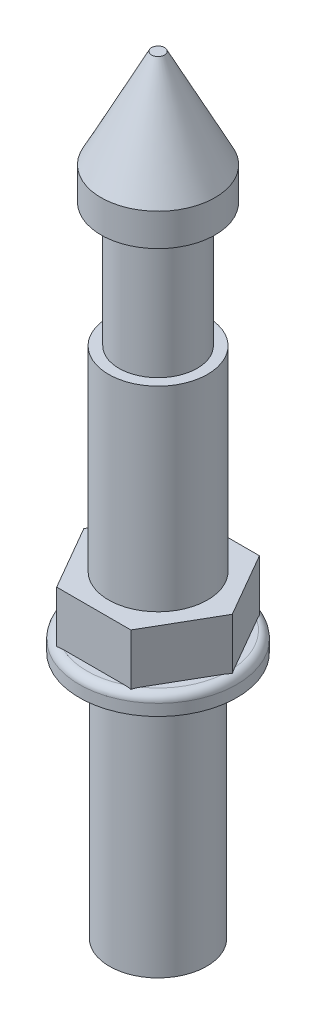
ISO-10303-21;
HEADER;
FILE_DESCRIPTION(('STEP AP214'),'2;1');
FILE_NAME('part.step','',(''),(''),'','','');
FILE_SCHEMA(('AUTOMOTIVE_DESIGN { 1 0 10303 214 1 1 1 1 }'));
ENDSEC;
DATA;
#1=APPLICATION_CONTEXT('core data for automotive mechanical design processes');
#2=APPLICATION_PROTOCOL_DEFINITION('international standard','automotive_design',2000,#1);
#3=PRODUCT_CONTEXT('',#1,'mechanical');
#4=PRODUCT('Part','Part','',(#3));
#5=PRODUCT_RELATED_PRODUCT_CATEGORY('part','',(#4));
#6=PRODUCT_DEFINITION_FORMATION('','',#4);
#7=PRODUCT_DEFINITION_CONTEXT('part definition',#1,'design');
#8=PRODUCT_DEFINITION('design','',#6,#7);
#9=PRODUCT_DEFINITION_SHAPE('','',#8);
#10=(LENGTH_UNIT() NAMED_UNIT(*) SI_UNIT(.MILLI.,.METRE.));
#11=(NAMED_UNIT(*) PLANE_ANGLE_UNIT() SI_UNIT($,.RADIAN.));
#12=(NAMED_UNIT(*) SI_UNIT($,.STERADIAN.) SOLID_ANGLE_UNIT());
#13=UNCERTAINTY_MEASURE_WITH_UNIT(LENGTH_MEASURE(1.E-05),#10,'distance_accuracy_value','');
#14=(GEOMETRIC_REPRESENTATION_CONTEXT(3) GLOBAL_UNCERTAINTY_ASSIGNED_CONTEXT((#13)) GLOBAL_UNIT_ASSIGNED_CONTEXT((#10,
#11,#12)) REPRESENTATION_CONTEXT('',''));
#15=CARTESIAN_POINT('',(0.,0.,0.));
#16=DIRECTION('',(0.,0.,1.));
#17=DIRECTION('',(1.,0.,0.));
#18=AXIS2_PLACEMENT_3D('',#15,#16,#17);
#19=CARTESIAN_POINT('',(0.,13.081,0.));
#20=DIRECTION('',(0.,-1.,0.));
#21=DIRECTION('',(0.,0.,-1.));
#22=AXIS2_PLACEMENT_3D('',#19,#20,#21);
#23=PLANE('',#22);
#24=DIRECTION('',(0.5,0.,-0.866025403784439));
#25=VECTOR('',#24,1.);
#26=CARTESIAN_POINT('',(3.63684481567929,13.081,0.));
#27=LINE('',#26,#25);
#28=CARTESIAN_POINT('',(1.98786542509556,13.081,2.85611608512498));
#29=VERTEX_POINT('',#28);
#30=CARTESIAN_POINT('',(3.46740179842337,13.081,0.293483914875022));
#31=VERTEX_POINT('',#30);
#32=EDGE_CURVE('E199',#29,#31,#27,.T.);
#33=ORIENTED_EDGE('',*,*,#32,.F.);
#34=CARTESIAN_POINT('',(0.,13.081,0.));
#35=DIRECTION('',(0.,-1.,0.));
#36=DIRECTION('',(0.,0.,-1.));
#37=AXIS2_PLACEMENT_3D('',#34,#35,#36);
#38=CIRCLE('',#37,3.4798);
#39=EDGE_CURVE('E216',#29,#31,#38,.F.);
#40=ORIENTED_EDGE('',*,*,#39,.T.);
#41=EDGE_LOOP('',(#33,#40));
#42=FACE_BOUND('',#41,.T.);
#43=ADVANCED_FACE('F37',(#42),#23,.F.);
#44=DIRECTION('',(-0.5,0.,-0.866025403784439));
#45=VECTOR('',#44,1.);
#46=CARTESIAN_POINT('',(1.81842240783965,13.081,-3.1496));
#47=LINE('',#46,#45);
#48=CARTESIAN_POINT('',(3.46740179842337,13.081,-0.293483914875021));
#49=VERTEX_POINT('',#48);
#50=CARTESIAN_POINT('',(1.98786542509557,13.081,-2.85611608512498));
#51=VERTEX_POINT('',#50);
#52=EDGE_CURVE('E152',#49,#51,#47,.T.);
#53=ORIENTED_EDGE('',*,*,#52,.F.);
#54=CARTESIAN_POINT('',(0.,13.081,0.));
#55=DIRECTION('',(0.,-1.,0.));
#56=DIRECTION('',(0.,0.,-1.));
#57=AXIS2_PLACEMENT_3D('',#54,#55,#56);
#58=CIRCLE('',#57,3.4798);
#59=EDGE_CURVE('E214',#49,#51,#58,.F.);
#60=ORIENTED_EDGE('',*,*,#59,.T.);
#61=EDGE_LOOP('',(#53,#60));
#62=FACE_BOUND('',#61,.T.);
#63=ADVANCED_FACE('F315',(#62),#23,.F.);
#64=DIRECTION('',(-1.,0.,0.));
#65=VECTOR('',#64,1.);
#66=CARTESIAN_POINT('',(-1.81842240783965,13.081,-3.1496));
#67=LINE('',#66,#65);
#68=CARTESIAN_POINT('',(1.47953637332781,13.081,-3.1496));
#69=VERTEX_POINT('',#68);
#70=CARTESIAN_POINT('',(-1.47953637332781,13.081,-3.1496));
#71=VERTEX_POINT('',#70);
#72=EDGE_CURVE('E155',#69,#71,#67,.T.);
#73=ORIENTED_EDGE('',*,*,#72,.F.);
#74=CARTESIAN_POINT('',(0.,13.081,0.));
#75=DIRECTION('',(0.,-1.,0.));
#76=DIRECTION('',(0.,0.,-1.));
#77=AXIS2_PLACEMENT_3D('',#74,#75,#76);
#78=CIRCLE('',#77,3.4798);
#79=EDGE_CURVE('E212',#69,#71,#78,.F.);
#80=ORIENTED_EDGE('',*,*,#79,.T.);
#81=EDGE_LOOP('',(#73,#80));
#82=FACE_BOUND('',#81,.T.);
#83=ADVANCED_FACE('F321',(#82),#23,.F.);
#84=DIRECTION('',(-0.5,0.,0.866025403784439));
#85=VECTOR('',#84,1.);
#86=CARTESIAN_POINT('',(-3.63684481567929,13.081,0.));
#87=LINE('',#86,#85);
#88=CARTESIAN_POINT('',(-1.98786542509556,13.081,-2.85611608512498));
#89=VERTEX_POINT('',#88);
#90=CARTESIAN_POINT('',(-3.46740179842337,13.081,-0.293483914875024));
#91=VERTEX_POINT('',#90);
#92=EDGE_CURVE('E347',#89,#91,#87,.T.);
#93=ORIENTED_EDGE('',*,*,#92,.F.);
#94=CARTESIAN_POINT('',(0.,13.081,0.));
#95=DIRECTION('',(0.,-1.,0.));
#96=DIRECTION('',(0.,0.,-1.));
#97=AXIS2_PLACEMENT_3D('',#94,#95,#96);
#98=CIRCLE('',#97,3.4798);
#99=EDGE_CURVE('E210',#89,#91,#98,.F.);
#100=ORIENTED_EDGE('',*,*,#99,.T.);
#101=EDGE_LOOP('',(#93,#100));
#102=FACE_BOUND('',#101,.T.);
#103=ADVANCED_FACE('F335',(#102),#23,.F.);
#104=DIRECTION('',(0.5,0.,0.866025403784439));
#105=VECTOR('',#104,1.);
#106=CARTESIAN_POINT('',(-1.81842240783965,13.081,3.1496));
#107=LINE('',#106,#105);
#108=CARTESIAN_POINT('',(-3.46740179842337,13.081,0.293483914875024));
#109=VERTEX_POINT('',#108);
#110=CARTESIAN_POINT('',(-1.98786542509557,13.081,2.85611608512498));
#111=VERTEX_POINT('',#110);
#112=EDGE_CURVE('E343',#109,#111,#107,.T.);
#113=ORIENTED_EDGE('',*,*,#112,.F.);
#114=CARTESIAN_POINT('',(0.,13.081,0.));
#115=DIRECTION('',(0.,-1.,0.));
#116=DIRECTION('',(0.,0.,-1.));
#117=AXIS2_PLACEMENT_3D('',#114,#115,#116);
#118=CIRCLE('',#117,3.4798);
#119=EDGE_CURVE('E208',#109,#111,#118,.F.);
#120=ORIENTED_EDGE('',*,*,#119,.T.);
#121=EDGE_LOOP('',(#113,#120));
#122=FACE_BOUND('',#121,.T.);
#123=ADVANCED_FACE('F241',(#122),#23,.F.);
#124=CARTESIAN_POINT('',(1.81842240783965,15.5702,-3.1496));
#125=DIRECTION('',(0.866025403784439,0.,-0.5));
#126=DIRECTION('',(-0.5,0.,-0.866025403784439));
#127=AXIS2_PLACEMENT_3D('',#124,#125,#126);
#128=PLANE('',#127);
#129=DIRECTION('',(0.,-1.,0.));
#130=VECTOR('',#129,1.);
#131=CARTESIAN_POINT('',(3.63684481567929,15.5702,0.));
#132=LINE('',#131,#130);
#133=CARTESIAN_POINT('',(3.63684481567929,15.5702,0.));
#134=VERTEX_POINT('',#133);
#135=CARTESIAN_POINT('',(3.63684481567929,13.0471281116084,0.));
#136=VERTEX_POINT('',#135);
#137=EDGE_CURVE('E128',#134,#136,#132,.T.);
#138=ORIENTED_EDGE('',*,*,#137,.T.);
#139=CARTESIAN_POINT('',(3.63684481567929,13.0471281116084,0.));
#140=CARTESIAN_POINT('',(3.62294238339711,13.0534042136599,-0.0240797190615206));
#141=CARTESIAN_POINT('',(3.60893347220989,13.058642846511,-0.0483438649964974));
#142=CARTESIAN_POINT('',(3.5808177331949,13.0673018510737,-0.0970417534628225));
#143=CARTESIAN_POINT('',(3.56671133013272,13.0707276787798,-0.121474760278549));
#144=CARTESIAN_POINT('',(3.53843999214469,13.0760507032769,-0.170442154071771));
#145=CARTESIAN_POINT('',(3.52427510229132,13.0779489133294,-0.194976462981424));
#146=CARTESIAN_POINT('',(3.4958726946034,13.0804230162406,-0.244170876154193));
#147=CARTESIAN_POINT('',(3.48163508673833,13.0809948864831,-0.268831136354733));
#148=CARTESIAN_POINT('',(3.46740179842337,13.081,-0.29348391487502));
#149=B_SPLINE_CURVE_WITH_KNOTS('',3,(#139,#140,#141,#142,#143,#144,#145,#146,#147,#148),
.UNSPECIFIED.,.F.,.F.,(4,2,2,2,4),(0.,0.0854638151773966,0.170668925734185,0.255817473468294,
0.341223929882869),.UNSPECIFIED.);
#150=EDGE_CURVE('E223',#136,#49,#149,.T.);
#151=ORIENTED_EDGE('',*,*,#150,.T.);
#152=ORIENTED_EDGE('',*,*,#52,.T.);
#153=CARTESIAN_POINT('',(1.98786542509557,13.081,-2.85611608512498));
#154=CARTESIAN_POINT('',(1.9736321367806,13.0809948864832,-2.88076886364528));
#155=CARTESIAN_POINT('',(1.95939452891552,13.0804230162406,-2.90542912384583));
#156=CARTESIAN_POINT('',(1.9309921212276,13.0779489133293,-2.9546235370186));
#157=CARTESIAN_POINT('',(1.91682723137423,13.0760507032769,-2.97915784592826));
#158=CARTESIAN_POINT('',(1.88855589338618,13.0707276787798,-3.0281252397215));
#159=CARTESIAN_POINT('',(1.874449490324,13.0673018510738,-3.05255824653725));
#160=CARTESIAN_POINT('',(1.84633375130899,13.0586428465109,-3.10125613500358));
#161=CARTESIAN_POINT('',(1.83232484012179,13.0534042136596,-3.12552028093854));
#162=CARTESIAN_POINT('',(1.81842240783965,13.0471281116076,-3.1496));
#163=B_SPLINE_CURVE_WITH_KNOTS('',3,(#153,#154,#155,#156,#157,#158,#159,#160,#161,#162),
.UNSPECIFIED.,.F.,.F.,(4,2,2,2,4),(0.,0.0854064564146084,0.170555004148727,0.255760114705559,
0.341223929883028),.UNSPECIFIED.);
#164=CARTESIAN_POINT('',(1.81842240783965,13.0471281116084,-3.1496));
#165=VERTEX_POINT('',#164);
#166=EDGE_CURVE('E245',#51,#165,#163,.T.);
#167=ORIENTED_EDGE('',*,*,#166,.T.);
#168=DIRECTION('',(0.,-1.,0.));
#169=VECTOR('',#168,1.);
#170=CARTESIAN_POINT('',(1.81842240783965,15.5702,-3.1496));
#171=LINE('',#170,#169);
#172=CARTESIAN_POINT('',(1.81842240783965,15.5702,-3.1496));
#173=VERTEX_POINT('',#172);
#174=EDGE_CURVE('E151',#173,#165,#171,.T.);
#175=ORIENTED_EDGE('',*,*,#174,.F.);
#176=DIRECTION('',(0.5,0.,0.866025403784439));
#177=VECTOR('',#176,1.);
#178=CARTESIAN_POINT('',(1.81842240783965,15.5702,-3.1496));
#179=LINE('',#178,#177);
#180=EDGE_CURVE('E144',#173,#134,#179,.T.);
#181=ORIENTED_EDGE('',*,*,#180,.T.);
#182=EDGE_LOOP('',(#138,#151,#152,#167,#175,#181));
#183=FACE_BOUND('',#182,.T.);
#184=ADVANCED_FACE('F149',(#183),#128,.T.);
#185=CARTESIAN_POINT('',(-1.81842240783965,15.5702,-3.1496));
#186=DIRECTION('',(0.,0.,-1.));
#187=DIRECTION('',(-1.,0.,0.));
#188=AXIS2_PLACEMENT_3D('',#185,#186,#187);
#189=PLANE('',#188);
#190=ORIENTED_EDGE('',*,*,#174,.T.);
#191=CARTESIAN_POINT('',(1.81842240783965,13.0471281116084,-3.1496));
#192=CARTESIAN_POINT('',(1.79061754327529,13.0534042136599,-3.1496));
#193=CARTESIAN_POINT('',(1.76259972090086,13.058642846511,-3.1496));
#194=CARTESIAN_POINT('',(1.70636824287086,13.0673018510737,-3.1496));
#195=CARTESIAN_POINT('',(1.67815543674651,13.0707276787798,-3.1496));
#196=CARTESIAN_POINT('',(1.62161276077045,13.0760507032769,-3.1496));
#197=CARTESIAN_POINT('',(1.59328298106371,13.0779489133294,-3.1496));
#198=CARTESIAN_POINT('',(1.53647816568786,13.0804230162406,-3.1496));
#199=CARTESIAN_POINT('',(1.50800294995773,13.0809948864831,-3.1496));
#200=CARTESIAN_POINT('',(1.47953637332781,13.081,-3.1496));
#201=B_SPLINE_CURVE_WITH_KNOTS('',3,(#191,#192,#193,#194,#195,#196,#197,#198,#199,#200),
.UNSPECIFIED.,.F.,.F.,(4,2,2,2,4),(0.,0.0854638151773963,0.170668925734185,0.255817473468294,
0.34122392988287),.UNSPECIFIED.);
#202=EDGE_CURVE('E250',#165,#69,#201,.T.);
#203=ORIENTED_EDGE('',*,*,#202,.T.);
#204=ORIENTED_EDGE('',*,*,#72,.T.);
#205=CARTESIAN_POINT('',(-1.47953637332781,13.081,-3.1496));
#206=CARTESIAN_POINT('',(-1.50800294995774,13.0809948864832,-3.1496));
#207=CARTESIAN_POINT('',(-1.53647816568789,13.0804230162406,-3.1496));
#208=CARTESIAN_POINT('',(-1.59328298106374,13.0779489133293,-3.1496));
#209=CARTESIAN_POINT('',(-1.62161276077048,13.0760507032769,-3.1496));
#210=CARTESIAN_POINT('',(-1.67815543674657,13.0707276787798,-3.1496));
#211=CARTESIAN_POINT('',(-1.70636824287094,13.0673018510738,-3.1496));
#212=CARTESIAN_POINT('',(-1.76259972090095,13.0586428465109,-3.1496));
#213=CARTESIAN_POINT('',(-1.79061754327536,13.0534042136596,-3.1496));
#214=CARTESIAN_POINT('',(-1.81842240783965,13.0471281116076,-3.1496));
#215=B_SPLINE_CURVE_WITH_KNOTS('',3,(#205,#206,#207,#208,#209,#210,#211,#212,#213,#214),
.UNSPECIFIED.,.F.,.F.,(4,2,2,2,4),(0.,0.0854064564146081,0.170555004148727,0.255760114705559,
0.341223929883028),.UNSPECIFIED.);
#216=CARTESIAN_POINT('',(-1.81842240783965,13.0471281116084,-3.1496));
#217=VERTEX_POINT('',#216);
#218=EDGE_CURVE('E256',#71,#217,#215,.T.);
#219=ORIENTED_EDGE('',*,*,#218,.T.);
#220=DIRECTION('',(0.,-1.,0.));
#221=VECTOR('',#220,1.);
#222=CARTESIAN_POINT('',(-1.81842240783965,15.5702,-3.1496));
#223=LINE('',#222,#221);
#224=CARTESIAN_POINT('',(-1.81842240783965,15.5702,-3.1496));
#225=VERTEX_POINT('',#224);
#226=EDGE_CURVE('E169',#225,#217,#223,.T.);
#227=ORIENTED_EDGE('',*,*,#226,.F.);
#228=DIRECTION('',(1.,0.,0.));
#229=VECTOR('',#228,1.);
#230=CARTESIAN_POINT('',(-1.81842240783965,15.5702,-3.1496));
#231=LINE('',#230,#229);
#232=EDGE_CURVE('E137',#225,#173,#231,.T.);
#233=ORIENTED_EDGE('',*,*,#232,.T.);
#234=EDGE_LOOP('',(#190,#203,#204,#219,#227,#233));
#235=FACE_BOUND('',#234,.T.);
#236=ADVANCED_FACE('F240',(#235),#189,.T.);
#237=CARTESIAN_POINT('',(-3.63684481567929,15.5702,0.));
#238=DIRECTION('',(-0.866025403784439,0.,-0.5));
#239=DIRECTION('',(-0.5,0.,0.866025403784439));
#240=AXIS2_PLACEMENT_3D('',#237,#238,#239);
#241=PLANE('',#240);
#242=ORIENTED_EDGE('',*,*,#226,.T.);
#243=CARTESIAN_POINT('',(-1.81842240783965,13.0471281116084,-3.1496));
#244=CARTESIAN_POINT('',(-1.83232484012183,13.0534042136599,-3.12552028093848));
#245=CARTESIAN_POINT('',(-1.84633375130904,13.058642846511,-3.1012561350035));
#246=CARTESIAN_POINT('',(-1.87444949032404,13.0673018510737,-3.05255824653718));
#247=CARTESIAN_POINT('',(-1.88855589338621,13.0707276787798,-3.02812523972145));
#248=CARTESIAN_POINT('',(-1.91682723137424,13.0760507032769,-2.97915784592823));
#249=CARTESIAN_POINT('',(-1.93099212122761,13.0779489133294,-2.95462353701857));
#250=CARTESIAN_POINT('',(-1.95939452891554,13.0804230162406,-2.9054291238458));
#251=CARTESIAN_POINT('',(-1.9736321367806,13.0809948864831,-2.88076886364526));
#252=CARTESIAN_POINT('',(-1.98786542509557,13.081,-2.85611608512498));
#253=B_SPLINE_CURVE_WITH_KNOTS('',3,(#243,#244,#245,#246,#247,#248,#249,#250,#251,#252),
.UNSPECIFIED.,.F.,.F.,(4,2,2,2,4),(0.,0.0854638151773967,0.170668925734186,0.255817473468295,
0.341223929882871),.UNSPECIFIED.);
#254=EDGE_CURVE('E275',#217,#89,#253,.T.);
#255=ORIENTED_EDGE('',*,*,#254,.T.);
#256=ORIENTED_EDGE('',*,*,#92,.T.);
#257=CARTESIAN_POINT('',(-3.46740179842337,13.081,-0.293483914875024));
#258=CARTESIAN_POINT('',(-3.48163508673834,13.0809948864832,-0.268831136354723));
#259=CARTESIAN_POINT('',(-3.49587269460341,13.0804230162406,-0.244170876154176));
#260=CARTESIAN_POINT('',(-3.52427510229134,13.0779489133293,-0.194976462981398));
#261=CARTESIAN_POINT('',(-3.53843999214471,13.0760507032769,-0.170442154071744));
#262=CARTESIAN_POINT('',(-3.56671133013276,13.0707276787798,-0.121474760278499));
#263=CARTESIAN_POINT('',(-3.58081773319494,13.0673018510738,-0.0970417534627511));
#264=CARTESIAN_POINT('',(-3.60893347220994,13.0586428465109,-0.0483438649964188));
#265=CARTESIAN_POINT('',(-3.62294238339715,13.0534042136596,-0.0240797190614568));
#266=CARTESIAN_POINT('',(-3.63684481567929,13.0471281116076,0.));
#267=B_SPLINE_CURVE_WITH_KNOTS('',3,(#257,#258,#259,#260,#261,#262,#263,#264,#265,#266),
.UNSPECIFIED.,.F.,.F.,(4,2,2,2,4),(0.,0.0854064564146081,0.170555004148726,0.255760114705559,
0.341223929883028),.UNSPECIFIED.);
#268=CARTESIAN_POINT('',(-3.63684481567929,13.0471281116084,0.));
#269=VERTEX_POINT('',#268);
#270=EDGE_CURVE('E280',#91,#269,#267,.T.);
#271=ORIENTED_EDGE('',*,*,#270,.T.);
#272=DIRECTION('',(0.,-1.,0.));
#273=VECTOR('',#272,1.);
#274=CARTESIAN_POINT('',(-3.63684481567929,15.5702,0.));
#275=LINE('',#274,#273);
#276=CARTESIAN_POINT('',(-3.63684481567929,15.5702,0.));
#277=VERTEX_POINT('',#276);
#278=EDGE_CURVE('E171',#277,#269,#275,.T.);
#279=ORIENTED_EDGE('',*,*,#278,.F.);
#280=DIRECTION('',(0.5,0.,-0.866025403784439));
#281=VECTOR('',#280,1.);
#282=CARTESIAN_POINT('',(-3.63684481567929,15.5702,0.));
#283=LINE('',#282,#281);
#284=EDGE_CURVE('E163',#277,#225,#283,.T.);
#285=ORIENTED_EDGE('',*,*,#284,.T.);
#286=EDGE_LOOP('',(#242,#255,#256,#271,#279,#285));
#287=FACE_BOUND('',#286,.T.);
#288=ADVANCED_FACE('F265',(#287),#241,.T.);
#289=CARTESIAN_POINT('',(-1.81842240783965,15.5702,3.1496));
#290=DIRECTION('',(-0.866025403784439,0.,0.5));
#291=DIRECTION('',(0.5,0.,0.866025403784439));
#292=AXIS2_PLACEMENT_3D('',#289,#290,#291);
#293=PLANE('',#292);
#294=ORIENTED_EDGE('',*,*,#278,.T.);
#295=CARTESIAN_POINT('',(-3.63684481567929,13.0471281116084,0.));
#296=CARTESIAN_POINT('',(-3.62294238339711,13.0534042136599,0.024079719061521));
#297=CARTESIAN_POINT('',(-3.6089334722099,13.058642846511,0.0483438649964981));
#298=CARTESIAN_POINT('',(-3.5808177331949,13.0673018510737,0.0970417534628235));
#299=CARTESIAN_POINT('',(-3.56671133013272,13.0707276787798,0.12147476027855));
#300=CARTESIAN_POINT('',(-3.53843999214469,13.0760507032769,0.170442154071773));
#301=CARTESIAN_POINT('',(-3.52427510229132,13.0779489133294,0.194976462981426));
#302=CARTESIAN_POINT('',(-3.4958726946034,13.0804230162406,0.244170876154196));
#303=CARTESIAN_POINT('',(-3.48163508673833,13.0809948864831,0.268831136354736));
#304=CARTESIAN_POINT('',(-3.46740179842337,13.081,0.293483914875023));
#305=B_SPLINE_CURVE_WITH_KNOTS('',3,(#295,#296,#297,#298,#299,#300,#301,#302,#303,#304),
.UNSPECIFIED.,.F.,.F.,(4,2,2,2,4),(0.,0.0854638151773974,0.170668925734186,0.255817473468296,
0.341223929882872),.UNSPECIFIED.);
#306=EDGE_CURVE('E286',#269,#109,#305,.T.);
#307=ORIENTED_EDGE('',*,*,#306,.T.);
#308=ORIENTED_EDGE('',*,*,#112,.T.);
#309=CARTESIAN_POINT('',(-1.98786542509557,13.081,2.85611608512498));
#310=CARTESIAN_POINT('',(-1.9736321367806,13.0809948864832,2.88076886364528));
#311=CARTESIAN_POINT('',(-1.95939452891553,13.0804230162406,2.90542912384582));
#312=CARTESIAN_POINT('',(-1.9309921212276,13.0779489133293,2.9546235370186));
#313=CARTESIAN_POINT('',(-1.91682723137423,13.0760507032769,2.97915784592826));
#314=CARTESIAN_POINT('',(-1.88855589338618,13.0707276787798,3.0281252397215));
#315=CARTESIAN_POINT('',(-1.874449490324,13.0673018510738,3.05255824653725));
#316=CARTESIAN_POINT('',(-1.846333751309,13.0586428465109,3.10125613500358));
#317=CARTESIAN_POINT('',(-1.83232484012179,13.0534042136596,3.12552028093854));
#318=CARTESIAN_POINT('',(-1.81842240783965,13.0471281116076,3.1496));
#319=B_SPLINE_CURVE_WITH_KNOTS('',3,(#309,#310,#311,#312,#313,#314,#315,#316,#317,#318),
.UNSPECIFIED.,.F.,.F.,(4,2,2,2,4),(0.,0.0854064564146094,0.170555004148728,0.255760114705561,
0.34122392988303),.UNSPECIFIED.);
#320=CARTESIAN_POINT('',(-1.81842240783965,13.0471281116084,3.1496));
#321=VERTEX_POINT('',#320);
#322=EDGE_CURVE('E291',#111,#321,#319,.T.);
#323=ORIENTED_EDGE('',*,*,#322,.T.);
#324=DIRECTION('',(0.,-1.,0.));
#325=VECTOR('',#324,1.);
#326=CARTESIAN_POINT('',(-1.81842240783965,15.5702,3.1496));
#327=LINE('',#326,#325);
#328=CARTESIAN_POINT('',(-1.81842240783965,15.5702,3.1496));
#329=VERTEX_POINT('',#328);
#330=EDGE_CURVE('E64',#329,#321,#327,.T.);
#331=ORIENTED_EDGE('',*,*,#330,.F.);
#332=DIRECTION('',(-0.5,0.,-0.866025403784439));
#333=VECTOR('',#332,1.);
#334=CARTESIAN_POINT('',(-1.81842240783965,15.5702,3.1496));
#335=LINE('',#334,#333);
#336=EDGE_CURVE('E160',#329,#277,#335,.T.);
#337=ORIENTED_EDGE('',*,*,#336,.T.);
#338=EDGE_LOOP('',(#294,#307,#308,#323,#331,#337));
#339=FACE_BOUND('',#338,.T.);
#340=ADVANCED_FACE('F271',(#339),#293,.T.);
#341=CARTESIAN_POINT('',(1.81842240783964,15.5702,3.1496));
#342=DIRECTION('',(0.,0.,1.));
#343=DIRECTION('',(1.,0.,0.));
#344=AXIS2_PLACEMENT_3D('',#341,#342,#343);
#345=PLANE('',#344);
#346=ORIENTED_EDGE('',*,*,#330,.T.);
#347=CARTESIAN_POINT('',(-1.81842240783965,13.0471281116084,3.1496));
#348=CARTESIAN_POINT('',(-1.79061754327529,13.0534042136599,3.1496));
#349=CARTESIAN_POINT('',(-1.76259972090086,13.058642846511,3.1496));
#350=CARTESIAN_POINT('',(-1.70636824287086,13.0673018510737,3.1496));
#351=CARTESIAN_POINT('',(-1.67815543674651,13.0707276787798,3.1496));
#352=CARTESIAN_POINT('',(-1.62161276077045,13.0760507032769,3.1496));
#353=CARTESIAN_POINT('',(-1.59328298106371,13.0779489133294,3.1496));
#354=CARTESIAN_POINT('',(-1.53647816568786,13.0804230162406,3.1496));
#355=CARTESIAN_POINT('',(-1.50800294995773,13.0809948864831,3.1496));
#356=CARTESIAN_POINT('',(-1.47953637332781,13.081,3.1496));
#357=B_SPLINE_CURVE_WITH_KNOTS('',3,(#347,#348,#349,#350,#351,#352,#353,#354,#355,#356),
.UNSPECIFIED.,.F.,.F.,(4,2,2,2,4),(0.,0.0854638151773977,0.170668925734187,0.255817473468297,
0.341223929882873),.UNSPECIFIED.);
#358=CARTESIAN_POINT('',(-1.47953637332781,13.081,3.1496));
#359=VERTEX_POINT('',#358);
#360=EDGE_CURVE('E296',#321,#359,#357,.T.);
#361=ORIENTED_EDGE('',*,*,#360,.T.);
#362=DIRECTION('',(1.,0.,0.));
#363=VECTOR('',#362,1.);
#364=CARTESIAN_POINT('',(1.81842240783964,13.081,3.1496));
#365=LINE('',#364,#363);
#366=CARTESIAN_POINT('',(1.4795363733278,13.081,3.1496));
#367=VERTEX_POINT('',#366);
#368=EDGE_CURVE('E307',#359,#367,#365,.T.);
#369=ORIENTED_EDGE('',*,*,#368,.T.);
#370=CARTESIAN_POINT('',(1.4795363733278,13.081,3.1496));
#371=CARTESIAN_POINT('',(1.50800294995774,13.0809948864832,3.1496));
#372=CARTESIAN_POINT('',(1.53647816568788,13.0804230162406,3.1496));
#373=CARTESIAN_POINT('',(1.59328298106374,13.0779489133293,3.1496));
#374=CARTESIAN_POINT('',(1.62161276077048,13.0760507032769,3.1496));
#375=CARTESIAN_POINT('',(1.67815543674657,13.0707276787798,3.1496));
#376=CARTESIAN_POINT('',(1.70636824287094,13.0673018510738,3.1496));
#377=CARTESIAN_POINT('',(1.76259972090095,13.0586428465109,3.1496));
#378=CARTESIAN_POINT('',(1.79061754327536,13.0534042136596,3.1496));
#379=CARTESIAN_POINT('',(1.81842240783964,13.0471281116076,3.1496));
#380=B_SPLINE_CURVE_WITH_KNOTS('',3,(#370,#371,#372,#373,#374,#375,#376,#377,#378,#379),
.UNSPECIFIED.,.F.,.F.,(4,2,2,2,4),(0.,0.0854064564146083,0.170555004148727,0.25576011470556,
0.341223929883028),.UNSPECIFIED.);
#381=CARTESIAN_POINT('',(1.81842240783964,13.0471281116084,3.1496));
#382=VERTEX_POINT('',#381);
#383=EDGE_CURVE('E50',#367,#382,#380,.T.);
#384=ORIENTED_EDGE('',*,*,#383,.T.);
#385=DIRECTION('',(0.,-1.,0.));
#386=VECTOR('',#385,1.);
#387=CARTESIAN_POINT('',(1.81842240783964,15.5702,3.1496));
#388=LINE('',#387,#386);
#389=CARTESIAN_POINT('',(1.81842240783964,15.5702,3.1496));
#390=VERTEX_POINT('',#389);
#391=EDGE_CURVE('E56',#390,#382,#388,.T.);
#392=ORIENTED_EDGE('',*,*,#391,.F.);
#393=DIRECTION('',(-1.,0.,0.));
#394=VECTOR('',#393,1.);
#395=CARTESIAN_POINT('',(1.81842240783964,15.5702,3.1496));
#396=LINE('',#395,#394);
#397=EDGE_CURVE('E147',#390,#329,#396,.T.);
#398=ORIENTED_EDGE('',*,*,#397,.T.);
#399=EDGE_LOOP('',(#346,#361,#369,#384,#392,#398));
#400=FACE_BOUND('',#399,.T.);
#401=ADVANCED_FACE('F233',(#400),#345,.T.);
#402=CARTESIAN_POINT('',(3.63684481567929,15.5702,0.));
#403=DIRECTION('',(0.866025403784439,0.,0.5));
#404=DIRECTION('',(0.5,0.,-0.866025403784439));
#405=AXIS2_PLACEMENT_3D('',#402,#403,#404);
#406=PLANE('',#405);
#407=ORIENTED_EDGE('',*,*,#391,.T.);
#408=CARTESIAN_POINT('',(1.81842240783964,13.0471281116084,3.1496));
#409=CARTESIAN_POINT('',(1.83232484012182,13.0534042136599,3.12552028093848));
#410=CARTESIAN_POINT('',(1.84633375130904,13.058642846511,3.1012561350035));
#411=CARTESIAN_POINT('',(1.87444949032404,13.0673018510737,3.05255824653718));
#412=CARTESIAN_POINT('',(1.88855589338621,13.0707276787798,3.02812523972145));
#413=CARTESIAN_POINT('',(1.91682723137424,13.0760507032769,2.97915784592823));
#414=CARTESIAN_POINT('',(1.93099212122761,13.0779489133294,2.95462353701858));
#415=CARTESIAN_POINT('',(1.95939452891554,13.0804230162406,2.90542912384581));
#416=CARTESIAN_POINT('',(1.9736321367806,13.0809948864831,2.88076886364527));
#417=CARTESIAN_POINT('',(1.98786542509556,13.081,2.85611608512498));
#418=B_SPLINE_CURVE_WITH_KNOTS('',3,(#408,#409,#410,#411,#412,#413,#414,#415,#416,#417),
.UNSPECIFIED.,.F.,.F.,(4,2,2,2,4),(0.,0.0854638151773973,0.170668925734186,0.255817473468296,
0.341223929882871),.UNSPECIFIED.);
#419=EDGE_CURVE('E11',#382,#29,#418,.T.);
#420=ORIENTED_EDGE('',*,*,#419,.T.);
#421=ORIENTED_EDGE('',*,*,#32,.T.);
#422=CARTESIAN_POINT('',(3.46740179842337,13.081,0.293483914875022));
#423=CARTESIAN_POINT('',(3.48163508673834,13.0809948864832,0.268831136354722));
#424=CARTESIAN_POINT('',(3.49587269460341,13.0804230162406,0.244170876154174));
#425=CARTESIAN_POINT('',(3.52427510229134,13.0779489133293,0.194976462981397));
#426=CARTESIAN_POINT('',(3.53843999214471,13.0760507032769,0.170442154071743));
#427=CARTESIAN_POINT('',(3.56671133013275,13.0707276787798,0.121474760278498));
#428=CARTESIAN_POINT('',(3.58081773319494,13.0673018510738,0.0970417534627503));
#429=CARTESIAN_POINT('',(3.60893347220994,13.0586428465109,0.0483438649964186));
#430=CARTESIAN_POINT('',(3.62294238339715,13.0534042136596,0.0240797190614569));
#431=CARTESIAN_POINT('',(3.63684481567929,13.0471281116076,0.));
#432=B_SPLINE_CURVE_WITH_KNOTS('',3,(#422,#423,#424,#425,#426,#427,#428,#429,#430,#431),
.UNSPECIFIED.,.F.,.F.,(4,2,2,2,4),(0.,0.0854064564146076,0.170555004148725,0.255760114705557,
0.341223929883025),.UNSPECIFIED.);
#433=EDGE_CURVE('E133',#31,#136,#432,.T.);
#434=ORIENTED_EDGE('',*,*,#433,.T.);
#435=ORIENTED_EDGE('',*,*,#137,.F.);
#436=DIRECTION('',(-0.5,0.,0.866025403784439));
#437=VECTOR('',#436,1.);
#438=CARTESIAN_POINT('',(3.63684481567929,15.5702,0.));
#439=LINE('',#438,#437);
#440=EDGE_CURVE('E131',#134,#390,#439,.T.);
#441=ORIENTED_EDGE('',*,*,#440,.T.);
#442=EDGE_LOOP('',(#407,#420,#421,#434,#435,#441));
#443=FACE_BOUND('',#442,.T.);
#444=ADVANCED_FACE('F130',(#443),#406,.T.);
#445=CARTESIAN_POINT('',(0.,0.,0.));
#446=DIRECTION('',(0.,-1.,0.));
#447=DIRECTION('',(0.,0.,-1.));
#448=AXIS2_PLACEMENT_3D('',#445,#446,#447);
#449=CYLINDRICAL_SURFACE('',#448,2.4257);
#450=CARTESIAN_POINT('',(0.,25.146,0.));
#451=DIRECTION('',(0.,-1.,0.));
#452=DIRECTION('',(0.,0.,-1.));
#453=AXIS2_PLACEMENT_3D('',#450,#451,#452);
#454=CIRCLE('',#453,2.4257);
#455=CARTESIAN_POINT('',(0.,25.146,-2.4257));
#456=VERTEX_POINT('',#455);
#457=EDGE_CURVE('E190',#456,#456,#454,.T.);
#458=ORIENTED_EDGE('',*,*,#457,.T.);
#459=EDGE_LOOP('',(#458));
#460=FACE_BOUND('',#459,.T.);
#461=CARTESIAN_POINT('',(0.,15.5702,0.));
#462=DIRECTION('',(0.,-1.,0.));
#463=DIRECTION('',(0.,0.,-1.));
#464=AXIS2_PLACEMENT_3D('',#461,#462,#463);
#465=CIRCLE('',#464,2.4257);
#466=CARTESIAN_POINT('',(0.,15.5702,-2.4257));
#467=VERTEX_POINT('',#466);
#468=EDGE_CURVE('E168',#467,#467,#465,.F.);
#469=ORIENTED_EDGE('',*,*,#468,.T.);
#470=EDGE_LOOP('',(#469));
#471=FACE_BOUND('',#470,.T.);
#472=ADVANCED_FACE('F232',(#460,#471),#449,.T.);
#473=CARTESIAN_POINT('',(2.4257,25.146,0.));
#474=DIRECTION('',(0.,1.,0.));
#475=DIRECTION('',(0.,0.,1.));
#476=AXIS2_PLACEMENT_3D('',#473,#474,#475);
#477=PLANE('',#476);
#478=CARTESIAN_POINT('',(0.,25.146,0.));
#479=DIRECTION('',(0.,-1.,0.));
#480=DIRECTION('',(0.,0.,-1.));
#481=AXIS2_PLACEMENT_3D('',#478,#479,#480);
#482=CIRCLE('',#481,1.9177);
#483=CARTESIAN_POINT('',(0.,25.146,-1.9177));
#484=VERTEX_POINT('',#483);
#485=EDGE_CURVE('E187',#484,#484,#482,.T.);
#486=ORIENTED_EDGE('',*,*,#485,.T.);
#487=EDGE_LOOP('',(#486));
#488=FACE_BOUND('',#487,.T.);
#489=ORIENTED_EDGE('',*,*,#457,.F.);
#490=EDGE_LOOP('',(#489));
#491=FACE_BOUND('',#490,.T.);
#492=ADVANCED_FACE('F382',(#488,#491),#477,.T.);
#493=CARTESIAN_POINT('',(0.,0.,0.));
#494=DIRECTION('',(0.,-1.,0.));
#495=DIRECTION('',(0.,0.,-1.));
#496=AXIS2_PLACEMENT_3D('',#493,#494,#495);
#497=CYLINDRICAL_SURFACE('',#496,1.9177);
#498=CARTESIAN_POINT('',(0.,31.242,0.));
#499=DIRECTION('',(0.,-1.,0.));
#500=DIRECTION('',(0.,0.,-1.));
#501=AXIS2_PLACEMENT_3D('',#498,#499,#500);
#502=CIRCLE('',#501,1.9177);
#503=CARTESIAN_POINT('',(0.,31.242,-1.9177));
#504=VERTEX_POINT('',#503);
#505=EDGE_CURVE('E184',#504,#504,#502,.T.);
#506=ORIENTED_EDGE('',*,*,#505,.T.);
#507=EDGE_LOOP('',(#506));
#508=FACE_BOUND('',#507,.T.);
#509=ORIENTED_EDGE('',*,*,#485,.F.);
#510=EDGE_LOOP('',(#509));
#511=FACE_BOUND('',#510,.T.);
#512=ADVANCED_FACE('F386',(#508,#511),#497,.T.);
#513=CARTESIAN_POINT('',(1.9177,31.242,0.));
#514=DIRECTION('',(0.,-1.,0.));
#515=DIRECTION('',(0.,0.,-1.));
#516=AXIS2_PLACEMENT_3D('',#513,#514,#515);
#517=PLANE('',#516);
#518=CARTESIAN_POINT('',(0.,31.242,0.));
#519=DIRECTION('',(0.,-1.,0.));
#520=DIRECTION('',(0.,0.,-1.));
#521=AXIS2_PLACEMENT_3D('',#518,#519,#520);
#522=CIRCLE('',#521,2.794);
#523=CARTESIAN_POINT('',(0.,31.242,-2.794));
#524=VERTEX_POINT('',#523);
#525=EDGE_CURVE('E181',#524,#524,#522,.T.);
#526=ORIENTED_EDGE('',*,*,#525,.T.);
#527=EDGE_LOOP('',(#526));
#528=FACE_BOUND('',#527,.T.);
#529=ORIENTED_EDGE('',*,*,#505,.F.);
#530=EDGE_LOOP('',(#529));
#531=FACE_BOUND('',#530,.T.);
#532=ADVANCED_FACE('F390',(#528,#531),#517,.T.);
#533=CARTESIAN_POINT('',(0.,0.,0.));
#534=DIRECTION('',(0.,-1.,0.));
#535=DIRECTION('',(0.,0.,-1.));
#536=AXIS2_PLACEMENT_3D('',#533,#534,#535);
#537=CYLINDRICAL_SURFACE('',#536,2.794);
#538=CARTESIAN_POINT('',(0.,32.8295,0.));
#539=DIRECTION('',(0.,-1.,0.));
#540=DIRECTION('',(0.,0.,-1.));
#541=AXIS2_PLACEMENT_3D('',#538,#539,#540);
#542=CIRCLE('',#541,2.794);
#543=CARTESIAN_POINT('',(0.,32.8295,-2.794));
#544=VERTEX_POINT('',#543);
#545=EDGE_CURVE('E178',#544,#544,#542,.T.);
#546=ORIENTED_EDGE('',*,*,#545,.T.);
#547=EDGE_LOOP('',(#546));
#548=FACE_BOUND('',#547,.T.);
#549=ORIENTED_EDGE('',*,*,#525,.F.);
#550=EDGE_LOOP('',(#549));
#551=FACE_BOUND('',#550,.T.);
#552=ADVANCED_FACE('F394',(#548,#551),#537,.T.);
#553=CARTESIAN_POINT('',(0.,32.8295,0.));
#554=DIRECTION('',(0.,-1.,0.));
#555=DIRECTION('',(0.,0.,-1.));
#556=AXIS2_PLACEMENT_3D('',#553,#554,#555);
#557=CONICAL_SURFACE('',#556,2.794,0.475189593819078);
#558=CARTESIAN_POINT('',(0.,37.6428,0.));
#559=DIRECTION('',(0.,-1.,0.));
#560=DIRECTION('',(0.,0.,-1.));
#561=AXIS2_PLACEMENT_3D('',#558,#559,#560);
#562=CIRCLE('',#561,0.3175);
#563=CARTESIAN_POINT('',(0.,37.6428,-0.317499999999998));
#564=VERTEX_POINT('',#563);
#565=EDGE_CURVE('E175',#564,#564,#562,.T.);
#566=CARTESIAN_POINT('',(0.,37.6428,-0.317499999999998));
#567=CARTESIAN_POINT('',(0.,37.5926614583333,-0.343296874999997));
#568=CARTESIAN_POINT('',(0.,37.5425229166667,-0.369093749999997));
#569=CARTESIAN_POINT('',(0.,37.4422458333333,-0.420687499999999));
#570=CARTESIAN_POINT('',(0.,37.3921072916667,-0.446484374999999));
#571=CARTESIAN_POINT('',(0.,37.2918302083333,-0.498078124999999));
#572=CARTESIAN_POINT('',(0.,37.2416916666667,-0.523874999999998));
#573=CARTESIAN_POINT('',(0.,37.1414145833333,-0.575468749999998));
#574=CARTESIAN_POINT('',(0.,37.0912760416667,-0.601265624999998));
#575=CARTESIAN_POINT('',(0.,36.9909989583333,-0.652859374999998));
#576=CARTESIAN_POINT('',(0.,36.9408604166667,-0.678656249999998));
#577=CARTESIAN_POINT('',(0.,36.8405833333333,-0.730249999999999));
#578=CARTESIAN_POINT('',(0.,36.7904447916667,-0.756046874999999));
#579=CARTESIAN_POINT('',(0.,36.6901677083333,-0.807640624999998));
#580=CARTESIAN_POINT('',(0.,36.6400291666667,-0.833437499999998));
#581=CARTESIAN_POINT('',(0.,36.5397520833333,-0.885031249999998));
#582=CARTESIAN_POINT('',(0.,36.4896135416667,-0.910828124999999));
#583=CARTESIAN_POINT('',(0.,36.3893364583333,-0.962421874999999));
#584=CARTESIAN_POINT('',(0.,36.3391979166667,-0.988218749999998));
#585=CARTESIAN_POINT('',(0.,36.2389208333333,-1.0398125));
#586=CARTESIAN_POINT('',(0.,36.1887822916667,-1.065609375));
#587=CARTESIAN_POINT('',(0.,36.0885052083333,-1.117203125));
#588=CARTESIAN_POINT('',(0.,36.0383666666667,-1.143));
#589=CARTESIAN_POINT('',(0.,35.9380895833333,-1.19459375));
#590=CARTESIAN_POINT('',(0.,35.8879510416667,-1.220390625));
#591=CARTESIAN_POINT('',(0.,35.7876739583333,-1.271984375));
#592=CARTESIAN_POINT('',(0.,35.7375354166667,-1.29778125));
#593=CARTESIAN_POINT('',(0.,35.6372583333333,-1.349375));
#594=CARTESIAN_POINT('',(0.,35.5871197916667,-1.375171875));
#595=CARTESIAN_POINT('',(0.,35.4868427083333,-1.426765625));
#596=CARTESIAN_POINT('',(0.,35.4367041666667,-1.4525625));
#597=CARTESIAN_POINT('',(0.,35.3364270833333,-1.50415625));
#598=CARTESIAN_POINT('',(0.,35.2862885416667,-1.529953125));
#599=CARTESIAN_POINT('',(0.,35.1860114583333,-1.581546875));
#600=CARTESIAN_POINT('',(0.,35.1358729166667,-1.60734375));
#601=CARTESIAN_POINT('',(0.,35.0355958333333,-1.6589375));
#602=CARTESIAN_POINT('',(0.,34.9854572916667,-1.684734375));
#603=CARTESIAN_POINT('',(0.,34.8851802083333,-1.736328125));
#604=CARTESIAN_POINT('',(0.,34.8350416666667,-1.762125));
#605=CARTESIAN_POINT('',(0.,34.7347645833333,-1.81371875));
#606=CARTESIAN_POINT('',(0.,34.6846260416667,-1.839515625));
#607=CARTESIAN_POINT('',(0.,34.5843489583333,-1.891109375));
#608=CARTESIAN_POINT('',(0.,34.5342104166667,-1.91690625));
#609=CARTESIAN_POINT('',(0.,34.4339333333333,-1.9685));
#610=CARTESIAN_POINT('',(0.,34.3837947916667,-1.994296875));
#611=CARTESIAN_POINT('',(0.,34.2835177083333,-2.045890625));
#612=CARTESIAN_POINT('',(0.,34.2333791666667,-2.0716875));
#613=CARTESIAN_POINT('',(0.,34.1331020833333,-2.12328125));
#614=CARTESIAN_POINT('',(0.,34.0829635416667,-2.149078125));
#615=CARTESIAN_POINT('',(0.,33.9826864583333,-2.200671875));
#616=CARTESIAN_POINT('',(0.,33.9325479166667,-2.22646875));
#617=CARTESIAN_POINT('',(0.,33.8322708333333,-2.2780625));
#618=CARTESIAN_POINT('',(0.,33.7821322916667,-2.303859375));
#619=CARTESIAN_POINT('',(0.,33.6818552083333,-2.355453125));
#620=CARTESIAN_POINT('',(0.,33.6317166666667,-2.38125));
#621=CARTESIAN_POINT('',(0.,33.5314395833333,-2.43284375));
#622=CARTESIAN_POINT('',(0.,33.4813010416667,-2.458640625));
#623=CARTESIAN_POINT('',(0.,33.3810239583333,-2.510234375));
#624=CARTESIAN_POINT('',(0.,33.3308854166667,-2.53603125));
#625=CARTESIAN_POINT('',(0.,33.2306083333334,-2.587625));
#626=CARTESIAN_POINT('',(0.,33.1804697916667,-2.613421875));
#627=CARTESIAN_POINT('',(0.,33.0801927083333,-2.665015625));
#628=CARTESIAN_POINT('',(0.,33.0300541666667,-2.6908125));
#629=CARTESIAN_POINT('',(0.,32.9297770833333,-2.74240625));
#630=CARTESIAN_POINT('',(0.,32.8796385416667,-2.768203125));
#631=CARTESIAN_POINT('',(0.,32.8295,-2.794));
#632=B_SPLINE_CURVE_WITH_KNOTS('',3,(#566,#567,#568,#569,#570,#571,#572,#573,#574,#575,#576,
#577,#578,#579,#580,#581,#582,#583,#584,#585,#586,#587,#588,#589,#590,#591,#592,#593,#594,#595,
#596,#597,#598,#599,#600,#601,#602,#603,#604,#605,#606,#607,#608,#609,#610,#611,#612,#613,#614,
#615,#616,#617,#618,#619,#620,#621,#622,#623,#624,#625,#626,#627,#628,#629,#630,#631),
.UNSPECIFIED.,.F.,.F.,(4,2,2,2,2,2,2,2,2,2,2,2,2,2,2,2,2,2,2,2,2,2,2,2,2,2,2,2,2,2,2,2,4),(0.,
0.16915723183486,0.338314463669713,0.507471695504573,0.676628927339427,0.84578615917428,
1.01494339100913,1.18410062284399,1.35325785467885,1.52241508651371,1.69157231834856,
1.86072955018341,2.02988678201827,2.19904401385313,2.36820124568798,2.53735847752284,
2.70651570935769,2.87567294119255,3.04483017302741,3.21398740486226,3.38314463669711,
3.55230186853197,3.72145910036683,3.89061633220168,4.05977356403654,4.22893079587139,
4.39808802770625,4.56724525954111,4.73640249137596,4.90555972321081,5.07471695504567,
5.24387418688053,5.41303141871539),.UNSPECIFIED.);
#633=EDGE_CURVE('BSEAM397',#564,#544,#632,.T.);
#634=ORIENTED_EDGE('',*,*,#565,.T.);
#635=ORIENTED_EDGE('',*,*,#545,.F.);
#636=ORIENTED_EDGE('',*,*,#633,.T.);
#637=ORIENTED_EDGE('',*,*,#633,.F.);
#638=EDGE_LOOP('',(#634,#636,#635,#637));
#639=FACE_BOUND('',#638,.T.);
#640=ADVANCED_FACE('F397',(#639),#557,.T.);
#641=CARTESIAN_POINT('',(0.3175,37.6428,0.));
#642=DIRECTION('',(0.,1.,0.));
#643=DIRECTION('',(0.,0.,1.));
#644=AXIS2_PLACEMENT_3D('',#641,#642,#643);
#645=PLANE('',#644);
#646=ORIENTED_EDGE('',*,*,#565,.F.);
#647=EDGE_LOOP('',(#646));
#648=FACE_BOUND('',#647,.T.);
#649=ADVANCED_FACE('F242',(#648),#645,.T.);
#650=CARTESIAN_POINT('',(0.,15.5702,0.));
#651=DIRECTION('',(0.,-1.,0.));
#652=DIRECTION('',(0.,0.,-1.));
#653=AXIS2_PLACEMENT_3D('',#650,#651,#652);
#654=PLANE('',#653);
#655=ORIENTED_EDGE('',*,*,#468,.F.);
#656=EDGE_LOOP('',(#655));
#657=FACE_BOUND('',#656,.T.);
#658=ORIENTED_EDGE('',*,*,#180,.F.);
#659=ORIENTED_EDGE('',*,*,#232,.F.);
#660=ORIENTED_EDGE('',*,*,#284,.F.);
#661=ORIENTED_EDGE('',*,*,#336,.F.);
#662=ORIENTED_EDGE('',*,*,#397,.F.);
#663=ORIENTED_EDGE('',*,*,#440,.F.);
#664=EDGE_LOOP('',(#658,#659,#660,#661,#662,#663));
#665=FACE_BOUND('',#664,.T.);
#666=ADVANCED_FACE('F142',(#657,#665),#654,.F.);
#667=CARTESIAN_POINT('',(0.,13.081,0.));
#668=DIRECTION('',(0.,-1.,0.));
#669=DIRECTION('',(0.,0.,-1.));
#670=AXIS2_PLACEMENT_3D('',#667,#668,#669);
#671=CYLINDRICAL_SURFACE('',#670,3.8608);
#672=CARTESIAN_POINT('',(0.,12.7,0.));
#673=DIRECTION('',(0.,-1.,0.));
#674=DIRECTION('',(0.,0.,-1.));
#675=AXIS2_PLACEMENT_3D('',#672,#673,#674);
#676=CIRCLE('',#675,3.8608);
#677=CARTESIAN_POINT('',(0.,12.7,-3.8608));
#678=VERTEX_POINT('',#677);
#679=EDGE_CURVE('E203',#678,#678,#676,.T.);
#680=ORIENTED_EDGE('',*,*,#679,.T.);
#681=EDGE_LOOP('',(#680));
#682=FACE_BOUND('',#681,.T.);
#683=CARTESIAN_POINT('',(0.,12.1412,0.));
#684=DIRECTION('',(0.,-1.,0.));
#685=DIRECTION('',(0.,0.,-1.));
#686=AXIS2_PLACEMENT_3D('',#683,#684,#685);
#687=CIRCLE('',#686,3.8608);
#688=CARTESIAN_POINT('',(0.,12.1412,-3.8608));
#689=VERTEX_POINT('',#688);
#690=EDGE_CURVE('E363',#689,#689,#687,.T.);
#691=ORIENTED_EDGE('',*,*,#690,.F.);
#692=EDGE_LOOP('',(#691));
#693=FACE_BOUND('',#692,.T.);
#694=ADVANCED_FACE('F325',(#682,#693),#671,.T.);
#695=ORIENTED_EDGE('',*,*,#368,.F.);
#696=CARTESIAN_POINT('',(0.,13.081,0.));
#697=DIRECTION('',(0.,-1.,0.));
#698=DIRECTION('',(0.,0.,-1.));
#699=AXIS2_PLACEMENT_3D('',#696,#697,#698);
#700=CIRCLE('',#699,3.4798);
#701=EDGE_CURVE('E206',#359,#367,#700,.F.);
#702=ORIENTED_EDGE('',*,*,#701,.T.);
#703=EDGE_LOOP('',(#695,#702));
#704=FACE_BOUND('',#703,.T.);
#705=ADVANCED_FACE('F317',(#704),#23,.F.);
#706=CARTESIAN_POINT('',(0.,0.,0.));
#707=DIRECTION('',(0.,-1.,0.));
#708=DIRECTION('',(0.,0.,-1.));
#709=AXIS2_PLACEMENT_3D('',#706,#707,#708);
#710=PLANE('',#709);
#711=CARTESIAN_POINT('',(0.,0.,0.));
#712=DIRECTION('',(0.,-1.,0.));
#713=DIRECTION('',(0.,0.,-1.));
#714=AXIS2_PLACEMENT_3D('',#711,#712,#713);
#715=CIRCLE('',#714,2.38125);
#716=CARTESIAN_POINT('',(0.,0.,-2.38125));
#717=VERTEX_POINT('',#716);
#718=EDGE_CURVE('E196',#717,#717,#715,.T.);
#719=ORIENTED_EDGE('',*,*,#718,.T.);
#720=EDGE_LOOP('',(#719));
#721=FACE_BOUND('',#720,.T.);
#722=ADVANCED_FACE('F324',(#721),#710,.T.);
#723=CARTESIAN_POINT('',(0.,0.,0.));
#724=DIRECTION('',(0.,-1.,0.));
#725=DIRECTION('',(0.,0.,-1.));
#726=AXIS2_PLACEMENT_3D('',#723,#724,#725);
#727=CYLINDRICAL_SURFACE('',#726,2.38125);
#728=CARTESIAN_POINT('',(0.,12.1412,0.));
#729=DIRECTION('',(0.,-1.,0.));
#730=DIRECTION('',(0.,0.,-1.));
#731=AXIS2_PLACEMENT_3D('',#728,#729,#730);
#732=CIRCLE('',#731,2.38125);
#733=CARTESIAN_POINT('',(0.,12.1412,-2.38125));
#734=VERTEX_POINT('',#733);
#735=EDGE_CURVE('E193',#734,#734,#732,.T.);
#736=ORIENTED_EDGE('',*,*,#735,.T.);
#737=EDGE_LOOP('',(#736));
#738=FACE_BOUND('',#737,.T.);
#739=ORIENTED_EDGE('',*,*,#718,.F.);
#740=EDGE_LOOP('',(#739));
#741=FACE_BOUND('',#740,.T.);
#742=ADVANCED_FACE('F331',(#738,#741),#727,.T.);
#743=CARTESIAN_POINT('',(2.38125,12.1412,0.));
#744=DIRECTION('',(0.,-1.,0.));
#745=DIRECTION('',(0.,0.,-1.));
#746=AXIS2_PLACEMENT_3D('',#743,#744,#745);
#747=PLANE('',#746);
#748=ORIENTED_EDGE('',*,*,#735,.F.);
#749=EDGE_LOOP('',(#748));
#750=FACE_BOUND('',#749,.T.);
#751=ORIENTED_EDGE('',*,*,#690,.T.);
#752=EDGE_LOOP('',(#751));
#753=FACE_BOUND('',#752,.T.);
#754=ADVANCED_FACE('F367',(#750,#753),#747,.T.);
#755=CARTESIAN_POINT('',(0.,12.7,0.));
#756=DIRECTION('',(0.,-1.,0.));
#757=DIRECTION('',(0.,0.,-1.));
#758=AXIS2_PLACEMENT_3D('',#755,#756,#757);
#759=TOROIDAL_SURFACE('',#758,3.4798,0.381);
#760=ORIENTED_EDGE('',*,*,#433,.F.);
#761=ORIENTED_EDGE('',*,*,#39,.F.);
#762=ORIENTED_EDGE('',*,*,#419,.F.);
#763=ORIENTED_EDGE('',*,*,#383,.F.);
#764=ORIENTED_EDGE('',*,*,#701,.F.);
#765=ORIENTED_EDGE('',*,*,#360,.F.);
#766=ORIENTED_EDGE('',*,*,#322,.F.);
#767=ORIENTED_EDGE('',*,*,#119,.F.);
#768=ORIENTED_EDGE('',*,*,#306,.F.);
#769=ORIENTED_EDGE('',*,*,#270,.F.);
#770=ORIENTED_EDGE('',*,*,#99,.F.);
#771=ORIENTED_EDGE('',*,*,#254,.F.);
#772=ORIENTED_EDGE('',*,*,#218,.F.);
#773=ORIENTED_EDGE('',*,*,#79,.F.);
#774=ORIENTED_EDGE('',*,*,#202,.F.);
#775=ORIENTED_EDGE('',*,*,#166,.F.);
#776=ORIENTED_EDGE('',*,*,#59,.F.);
#777=ORIENTED_EDGE('',*,*,#150,.F.);
#778=EDGE_LOOP('',(#760,#761,#762,#763,#764,#765,#766,#767,#768,#769,#770,#771,#772,#773,#774,
#775,#776,#777));
#779=FACE_BOUND('',#778,.T.);
#780=ORIENTED_EDGE('',*,*,#679,.F.);
#781=EDGE_LOOP('',(#780));
#782=FACE_BOUND('',#781,.T.);
#783=ADVANCED_FACE('F39',(#779,#782),#759,.T.);
#784=CLOSED_SHELL('',(#43,#63,#83,#103,#123,#184,#236,#288,#340,#401,#444,#472,#492,#512,#532,
#552,#640,#649,#666,#694,#705,#722,#742,#754,#783));
#785=MANIFOLD_SOLID_BREP('B2',#784);
#786=ADVANCED_BREP_SHAPE_REPRESENTATION('',(#18,#785),#14);
#787=SHAPE_DEFINITION_REPRESENTATION(#9,#786);
ENDSEC;
END-ISO-10303-21;
